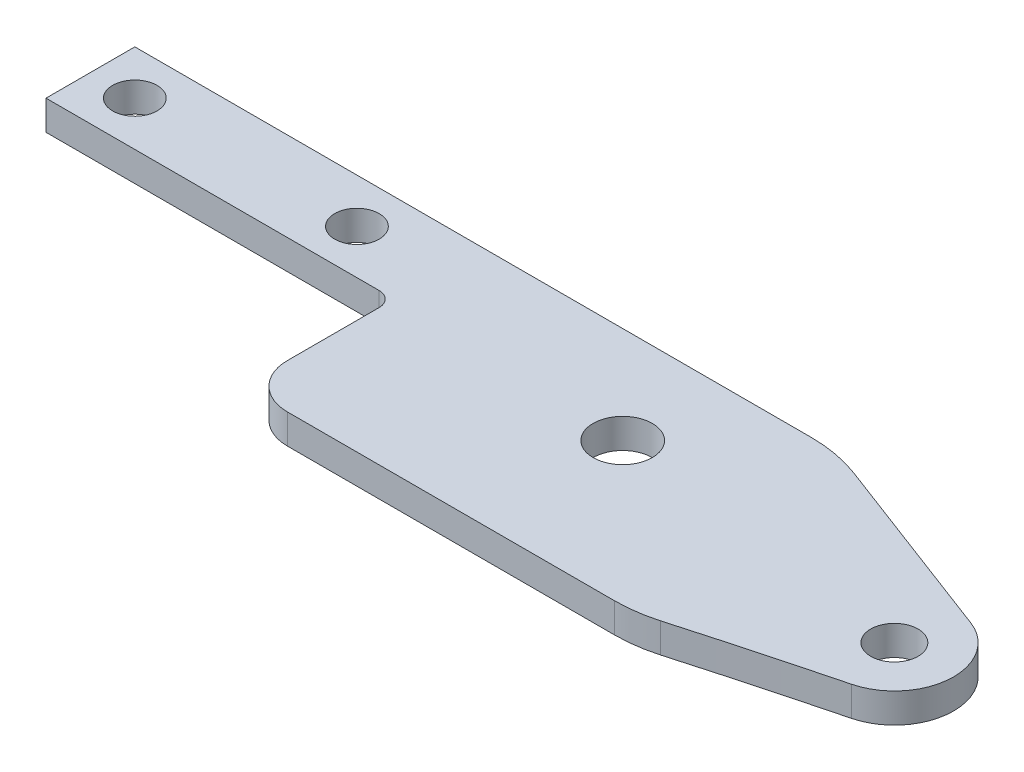
ISO-10303-21;
HEADER;
FILE_DESCRIPTION(('STEP AP214'),'2;1');
FILE_NAME('part.step','',(''),(''),'','','');
FILE_SCHEMA(('AUTOMOTIVE_DESIGN { 1 0 10303 214 1 1 1 1 }'));
ENDSEC;
DATA;
#1=APPLICATION_CONTEXT('core data for automotive mechanical design processes');
#2=APPLICATION_PROTOCOL_DEFINITION('international standard','automotive_design',2000,#1);
#3=PRODUCT_CONTEXT('',#1,'mechanical');
#4=PRODUCT('Part','Part','',(#3));
#5=PRODUCT_RELATED_PRODUCT_CATEGORY('part','',(#4));
#6=PRODUCT_DEFINITION_FORMATION('','',#4);
#7=PRODUCT_DEFINITION_CONTEXT('part definition',#1,'design');
#8=PRODUCT_DEFINITION('design','',#6,#7);
#9=PRODUCT_DEFINITION_SHAPE('','',#8);
#10=(LENGTH_UNIT() NAMED_UNIT(*) SI_UNIT(.MILLI.,.METRE.));
#11=(NAMED_UNIT(*) PLANE_ANGLE_UNIT() SI_UNIT($,.RADIAN.));
#12=(NAMED_UNIT(*) SI_UNIT($,.STERADIAN.) SOLID_ANGLE_UNIT());
#13=UNCERTAINTY_MEASURE_WITH_UNIT(LENGTH_MEASURE(1.E-05),#10,'distance_accuracy_value','');
#14=(GEOMETRIC_REPRESENTATION_CONTEXT(3) GLOBAL_UNCERTAINTY_ASSIGNED_CONTEXT((#13)) GLOBAL_UNIT_ASSIGNED_CONTEXT((#10,
#11,#12)) REPRESENTATION_CONTEXT('',''));
#15=CARTESIAN_POINT('',(0.,0.,0.));
#16=DIRECTION('',(0.,0.,1.));
#17=DIRECTION('',(1.,0.,0.));
#18=AXIS2_PLACEMENT_3D('',#15,#16,#17);
#19=CARTESIAN_POINT('',(57.5,2.,6.2));
#20=DIRECTION('',(0.,1.,0.));
#21=DIRECTION('',(0.,0.,1.));
#22=AXIS2_PLACEMENT_3D('',#19,#20,#21);
#23=PLANE('',#22);
#24=CARTESIAN_POINT('',(36.5,2.,3.55));
#25=DIRECTION('',(0.,1.,0.));
#26=DIRECTION('',(0.,0.,1.));
#27=AXIS2_PLACEMENT_3D('',#24,#25,#26);
#28=CIRCLE('',#27,2.00000000000001);
#29=CARTESIAN_POINT('',(36.5,2.,5.55000000000001));
#30=VERTEX_POINT('',#29);
#31=EDGE_CURVE('E417',#30,#30,#28,.T.);
#32=ORIENTED_EDGE('',*,*,#31,.F.);
#33=EDGE_LOOP('',(#32));
#34=FACE_BOUND('',#33,.T.);
#35=CARTESIAN_POINT('',(0.,2.,0.));
#36=DIRECTION('',(0.,1.,0.));
#37=DIRECTION('',(0.,0.,-1.));
#38=AXIS2_PLACEMENT_3D('',#35,#36,#37);
#39=CIRCLE('',#38,1.5);
#40=CARTESIAN_POINT('',(0.,2.,-1.5));
#41=VERTEX_POINT('',#40);
#42=EDGE_CURVE('E244',#41,#41,#39,.T.);
#43=ORIENTED_EDGE('',*,*,#42,.F.);
#44=EDGE_LOOP('',(#43));
#45=FACE_BOUND('',#44,.T.);
#46=DIRECTION('',(-0.935193561719164,0.,-0.354136982139715));
#47=VECTOR('',#46,1.);
#48=CARTESIAN_POINT('',(58.9165479285589,2.,2.45922575312334));
#49=LINE('',#48,#47);
#50=CARTESIAN_POINT('',(58.9165479285589,2.,2.45922575312334));
#51=VERTEX_POINT('',#50);
#52=CARTESIAN_POINT('',(46.2113875956134,2.,-2.35193561719164));
#53=VERTEX_POINT('',#52);
#54=EDGE_CURVE('E119',#51,#53,#49,.T.);
#55=ORIENTED_EDGE('',*,*,#54,.T.);
#56=CARTESIAN_POINT('',(42.6700177742163,2.,7.));
#57=DIRECTION('',(0.,1.,0.));
#58=DIRECTION('',(0.,0.,1.));
#59=AXIS2_PLACEMENT_3D('',#56,#57,#58);
#60=CIRCLE('',#59,10.);
#61=CARTESIAN_POINT('',(42.6700177742163,2.,-3.));
#62=VERTEX_POINT('',#61);
#63=EDGE_CURVE('E11',#53,#62,#60,.T.);
#64=ORIENTED_EDGE('',*,*,#63,.T.);
#65=DIRECTION('',(-1.,0.,0.));
#66=VECTOR('',#65,1.);
#67=CARTESIAN_POINT('',(44.5,2.,-3.));
#68=LINE('',#67,#66);
#69=CARTESIAN_POINT('',(-3.,2.,-3.));
#70=VERTEX_POINT('',#69);
#71=EDGE_CURVE('E127',#62,#70,#68,.T.);
#72=ORIENTED_EDGE('',*,*,#71,.T.);
#73=DIRECTION('',(0.,0.,1.));
#74=VECTOR('',#73,1.);
#75=CARTESIAN_POINT('',(-3.,2.,-3.));
#76=LINE('',#75,#74);
#77=CARTESIAN_POINT('',(-3.,2.,3.));
#78=VERTEX_POINT('',#77);
#79=EDGE_CURVE('E230',#70,#78,#76,.T.);
#80=ORIENTED_EDGE('',*,*,#79,.T.);
#81=DIRECTION('',(1.,0.,0.));
#82=VECTOR('',#81,1.);
#83=CARTESIAN_POINT('',(-3.,2.,3.));
#84=LINE('',#83,#82);
#85=CARTESIAN_POINT('',(19.5,2.,3.));
#86=VERTEX_POINT('',#85);
#87=EDGE_CURVE('E211',#78,#86,#84,.T.);
#88=ORIENTED_EDGE('',*,*,#87,.T.);
#89=CARTESIAN_POINT('',(19.5,2.,4.));
#90=DIRECTION('',(0.,1.,0.));
#91=DIRECTION('',(0.,0.,1.));
#92=AXIS2_PLACEMENT_3D('',#89,#90,#91);
#93=CIRCLE('',#92,1.);
#94=CARTESIAN_POINT('',(20.5,2.,4.));
#95=VERTEX_POINT('',#94);
#96=EDGE_CURVE('E156',#86,#95,#93,.F.);
#97=ORIENTED_EDGE('',*,*,#96,.T.);
#98=DIRECTION('',(0.,0.,1.));
#99=VECTOR('',#98,1.);
#100=CARTESIAN_POINT('',(20.5,2.,3.));
#101=LINE('',#100,#99);
#102=CARTESIAN_POINT('',(20.5,2.,10.2));
#103=VERTEX_POINT('',#102);
#104=EDGE_CURVE('E224',#95,#103,#101,.T.);
#105=ORIENTED_EDGE('',*,*,#104,.T.);
#106=CARTESIAN_POINT('',(23.5,2.,10.2));
#107=DIRECTION('',(0.,1.,0.));
#108=DIRECTION('',(0.,0.,1.));
#109=AXIS2_PLACEMENT_3D('',#106,#107,#108);
#110=CIRCLE('',#109,3.);
#111=CARTESIAN_POINT('',(23.5,2.,13.2));
#112=VERTEX_POINT('',#111);
#113=EDGE_CURVE('E226',#103,#112,#110,.T.);
#114=ORIENTED_EDGE('',*,*,#113,.T.);
#115=DIRECTION('',(1.,0.,0.));
#116=VECTOR('',#115,1.);
#117=CARTESIAN_POINT('',(45.5941572578322,2.,13.2));
#118=LINE('',#117,#116);
#119=CARTESIAN_POINT('',(45.5941572578322,2.,13.2));
#120=VERTEX_POINT('',#119);
#121=EDGE_CURVE('E228',#112,#120,#118,.T.);
#122=ORIENTED_EDGE('',*,*,#121,.T.);
#123=CARTESIAN_POINT('',(45.5941572578322,2.,3.19999999999998));
#124=DIRECTION('',(0.,1.,0.));
#125=DIRECTION('',(0.,0.,1.));
#126=AXIS2_PLACEMENT_3D('',#123,#124,#125);
#127=CIRCLE('',#126,10.);
#128=CARTESIAN_POINT('',(48.3339077215848,2.,12.8173680077434));
#129=VERTEX_POINT('',#128);
#130=EDGE_CURVE('E235',#120,#129,#127,.T.);
#131=ORIENTED_EDGE('',*,*,#130,.T.);
#132=CARTESIAN_POINT('',(152.444425344187,2.,378.277352301994));
#133=DIRECTION('',(0.,-1.,0.));
#134=DIRECTION('',(0.,0.,1.));
#135=AXIS2_PLACEMENT_3D('',#132,#133,#134);
#136=CIRCLE('',#135,380.);
#137=CARTESIAN_POINT('',(58.4890044306687,2.,10.0758057531458));
#138=VERTEX_POINT('',#137);
#139=EDGE_CURVE('E133',#129,#138,#136,.T.);
#140=ORIENTED_EDGE('',*,*,#139,.T.);
#141=CARTESIAN_POINT('',(57.5,2.,6.2));
#142=DIRECTION('',(0.,1.,0.));
#143=DIRECTION('',(0.,0.,1.));
#144=AXIS2_PLACEMENT_3D('',#141,#142,#143);
#145=CIRCLE('',#144,4.00000000000002);
#146=EDGE_CURVE('E128',#138,#51,#145,.T.);
#147=ORIENTED_EDGE('',*,*,#146,.T.);
#148=EDGE_LOOP('',(#55,#64,#72,#80,#88,#97,#105,#114,#122,#131,#140,#147));
#149=FACE_BOUND('',#148,.T.);
#150=CARTESIAN_POINT('',(57.5,2.,6.2));
#151=DIRECTION('',(0.,1.,0.));
#152=DIRECTION('',(0.,0.,1.));
#153=AXIS2_PLACEMENT_3D('',#150,#151,#152);
#154=CIRCLE('',#153,1.60000000000001);
#155=CARTESIAN_POINT('',(57.5,2.,7.8));
#156=VERTEX_POINT('',#155);
#157=EDGE_CURVE('E237',#156,#156,#154,.T.);
#158=ORIENTED_EDGE('',*,*,#157,.F.);
#159=EDGE_LOOP('',(#158));
#160=FACE_BOUND('',#159,.T.);
#161=CARTESIAN_POINT('',(15.,2.,0.));
#162=DIRECTION('',(0.,1.,0.));
#163=DIRECTION('',(0.,0.,-1.));
#164=AXIS2_PLACEMENT_3D('',#161,#162,#163);
#165=CIRCLE('',#164,1.5);
#166=CARTESIAN_POINT('',(15.,2.,-1.50000000000001));
#167=VERTEX_POINT('',#166);
#168=EDGE_CURVE('E422',#167,#167,#165,.T.);
#169=ORIENTED_EDGE('',*,*,#168,.F.);
#170=EDGE_LOOP('',(#169));
#171=FACE_BOUND('',#170,.T.);
#172=ADVANCED_FACE('F34',(#34,#45,#149,#160,#171),#23,.T.);
#173=CARTESIAN_POINT('',(57.5,0.,6.2));
#174=DIRECTION('',(0.,1.,0.));
#175=DIRECTION('',(0.,0.,1.));
#176=AXIS2_PLACEMENT_3D('',#173,#174,#175);
#177=PLANE('',#176);
#178=CARTESIAN_POINT('',(36.5,0.,3.55));
#179=DIRECTION('',(0.,1.,0.));
#180=DIRECTION('',(0.,0.,1.));
#181=AXIS2_PLACEMENT_3D('',#178,#179,#180);
#182=CIRCLE('',#181,2.00000000000001);
#183=CARTESIAN_POINT('',(36.5,0.,5.55000000000001));
#184=VERTEX_POINT('',#183);
#185=EDGE_CURVE('E415',#184,#184,#182,.T.);
#186=ORIENTED_EDGE('',*,*,#185,.T.);
#187=EDGE_LOOP('',(#186));
#188=FACE_BOUND('',#187,.T.);
#189=DIRECTION('',(-1.,0.,0.));
#190=VECTOR('',#189,1.);
#191=CARTESIAN_POINT('',(44.5,0.,-3.));
#192=LINE('',#191,#190);
#193=CARTESIAN_POINT('',(42.6700177742163,0.,-3.));
#194=VERTEX_POINT('',#193);
#195=CARTESIAN_POINT('',(-3.,0.,-3.));
#196=VERTEX_POINT('',#195);
#197=EDGE_CURVE('E166',#194,#196,#192,.T.);
#198=ORIENTED_EDGE('',*,*,#197,.F.);
#199=CARTESIAN_POINT('',(42.6700177742163,0.,7.));
#200=DIRECTION('',(0.,1.,0.));
#201=DIRECTION('',(0.,0.,1.));
#202=AXIS2_PLACEMENT_3D('',#199,#200,#201);
#203=CIRCLE('',#202,10.);
#204=CARTESIAN_POINT('',(46.2113875956134,0.,-2.35193561719164));
#205=VERTEX_POINT('',#204);
#206=EDGE_CURVE('E56',#194,#205,#203,.F.);
#207=ORIENTED_EDGE('',*,*,#206,.T.);
#208=DIRECTION('',(-0.935193561719164,0.,-0.354136982139715));
#209=VECTOR('',#208,1.);
#210=CARTESIAN_POINT('',(58.9165479285589,0.,2.45922575312334));
#211=LINE('',#210,#209);
#212=CARTESIAN_POINT('',(58.9165479285589,0.,2.45922575312334));
#213=VERTEX_POINT('',#212);
#214=EDGE_CURVE('E173',#213,#205,#211,.T.);
#215=ORIENTED_EDGE('',*,*,#214,.F.);
#216=CARTESIAN_POINT('',(57.5,0.,6.2));
#217=DIRECTION('',(0.,1.,0.));
#218=DIRECTION('',(0.,0.,1.));
#219=AXIS2_PLACEMENT_3D('',#216,#217,#218);
#220=CIRCLE('',#219,4.00000000000002);
#221=CARTESIAN_POINT('',(58.4890044306687,0.,10.0758057531458));
#222=VERTEX_POINT('',#221);
#223=EDGE_CURVE('E141',#222,#213,#220,.T.);
#224=ORIENTED_EDGE('',*,*,#223,.F.);
#225=CARTESIAN_POINT('',(152.444425344187,0.,378.277352301994));
#226=DIRECTION('',(0.,-1.,0.));
#227=DIRECTION('',(0.,0.,1.));
#228=AXIS2_PLACEMENT_3D('',#225,#226,#227);
#229=CIRCLE('',#228,380.);
#230=CARTESIAN_POINT('',(48.3339077215848,0.,12.8173680077434));
#231=VERTEX_POINT('',#230);
#232=EDGE_CURVE('E137',#231,#222,#229,.T.);
#233=ORIENTED_EDGE('',*,*,#232,.F.);
#234=CARTESIAN_POINT('',(45.5941572578322,0.,3.19999999999998));
#235=DIRECTION('',(0.,1.,0.));
#236=DIRECTION('',(0.,0.,1.));
#237=AXIS2_PLACEMENT_3D('',#234,#235,#236);
#238=CIRCLE('',#237,10.);
#239=CARTESIAN_POINT('',(45.5941572578322,0.,13.2));
#240=VERTEX_POINT('',#239);
#241=EDGE_CURVE('E188',#240,#231,#238,.T.);
#242=ORIENTED_EDGE('',*,*,#241,.F.);
#243=DIRECTION('',(1.,0.,0.));
#244=VECTOR('',#243,1.);
#245=CARTESIAN_POINT('',(45.5941572578322,0.,13.2));
#246=LINE('',#245,#244);
#247=CARTESIAN_POINT('',(23.5,0.,13.2));
#248=VERTEX_POINT('',#247);
#249=EDGE_CURVE('E186',#248,#240,#246,.T.);
#250=ORIENTED_EDGE('',*,*,#249,.F.);
#251=CARTESIAN_POINT('',(23.5,0.,10.2));
#252=DIRECTION('',(0.,1.,0.));
#253=DIRECTION('',(0.,0.,1.));
#254=AXIS2_PLACEMENT_3D('',#251,#252,#253);
#255=CIRCLE('',#254,3.);
#256=CARTESIAN_POINT('',(20.5,0.,10.2));
#257=VERTEX_POINT('',#256);
#258=EDGE_CURVE('E184',#257,#248,#255,.T.);
#259=ORIENTED_EDGE('',*,*,#258,.F.);
#260=DIRECTION('',(0.,0.,1.));
#261=VECTOR('',#260,1.);
#262=CARTESIAN_POINT('',(20.5,0.,3.));
#263=LINE('',#262,#261);
#264=CARTESIAN_POINT('',(20.5,0.,4.));
#265=VERTEX_POINT('',#264);
#266=EDGE_CURVE('E182',#265,#257,#263,.T.);
#267=ORIENTED_EDGE('',*,*,#266,.F.);
#268=CARTESIAN_POINT('',(19.5,0.,4.));
#269=DIRECTION('',(0.,1.,0.));
#270=DIRECTION('',(0.,0.,1.));
#271=AXIS2_PLACEMENT_3D('',#268,#269,#270);
#272=CIRCLE('',#271,1.);
#273=CARTESIAN_POINT('',(19.5,0.,3.));
#274=VERTEX_POINT('',#273);
#275=EDGE_CURVE('E154',#265,#274,#272,.T.);
#276=ORIENTED_EDGE('',*,*,#275,.T.);
#277=DIRECTION('',(1.,0.,0.));
#278=VECTOR('',#277,1.);
#279=CARTESIAN_POINT('',(-3.,0.,3.));
#280=LINE('',#279,#278);
#281=CARTESIAN_POINT('',(-3.,0.,3.));
#282=VERTEX_POINT('',#281);
#283=EDGE_CURVE('E175',#282,#274,#280,.T.);
#284=ORIENTED_EDGE('',*,*,#283,.F.);
#285=DIRECTION('',(0.,0.,1.));
#286=VECTOR('',#285,1.);
#287=CARTESIAN_POINT('',(-3.,0.,-3.));
#288=LINE('',#287,#286);
#289=EDGE_CURVE('E172',#196,#282,#288,.T.);
#290=ORIENTED_EDGE('',*,*,#289,.F.);
#291=EDGE_LOOP('',(#198,#207,#215,#224,#233,#242,#250,#259,#267,#276,#284,#290));
#292=FACE_BOUND('',#291,.T.);
#293=CARTESIAN_POINT('',(57.5,0.,6.2));
#294=DIRECTION('',(0.,1.,0.));
#295=DIRECTION('',(0.,0.,1.));
#296=AXIS2_PLACEMENT_3D('',#293,#294,#295);
#297=CIRCLE('',#296,1.60000000000001);
#298=CARTESIAN_POINT('',(57.5,0.,7.8));
#299=VERTEX_POINT('',#298);
#300=EDGE_CURVE('E239',#299,#299,#297,.T.);
#301=ORIENTED_EDGE('',*,*,#300,.T.);
#302=EDGE_LOOP('',(#301));
#303=FACE_BOUND('',#302,.T.);
#304=CARTESIAN_POINT('',(0.,0.,0.));
#305=DIRECTION('',(0.,1.,0.));
#306=DIRECTION('',(0.,0.,-1.));
#307=AXIS2_PLACEMENT_3D('',#304,#305,#306);
#308=CIRCLE('',#307,1.5);
#309=CARTESIAN_POINT('',(0.,0.,-1.5));
#310=VERTEX_POINT('',#309);
#311=EDGE_CURVE('E247',#310,#310,#308,.T.);
#312=ORIENTED_EDGE('',*,*,#311,.T.);
#313=EDGE_LOOP('',(#312));
#314=FACE_BOUND('',#313,.T.);
#315=CARTESIAN_POINT('',(15.,0.,0.));
#316=DIRECTION('',(0.,1.,0.));
#317=DIRECTION('',(0.,0.,-1.));
#318=AXIS2_PLACEMENT_3D('',#315,#316,#317);
#319=CIRCLE('',#318,1.5);
#320=CARTESIAN_POINT('',(15.,0.,-1.50000000000001));
#321=VERTEX_POINT('',#320);
#322=EDGE_CURVE('E419',#321,#321,#319,.T.);
#323=ORIENTED_EDGE('',*,*,#322,.T.);
#324=EDGE_LOOP('',(#323));
#325=FACE_BOUND('',#324,.T.);
#326=ADVANCED_FACE('F169',(#188,#292,#303,#314,#325),#177,.F.);
#327=CARTESIAN_POINT('',(57.5,2.,6.2));
#328=DIRECTION('',(0.,-1.,0.));
#329=DIRECTION('',(0.,0.,-1.));
#330=AXIS2_PLACEMENT_3D('',#327,#328,#329);
#331=CYLINDRICAL_SURFACE('',#330,4.00000000000002);
#332=ORIENTED_EDGE('',*,*,#223,.T.);
#333=DIRECTION('',(0.,-1.,0.));
#334=VECTOR('',#333,1.);
#335=CARTESIAN_POINT('',(58.9165479285589,2.,2.45922575312334));
#336=LINE('',#335,#334);
#337=EDGE_CURVE('E123',#51,#213,#336,.T.);
#338=ORIENTED_EDGE('',*,*,#337,.F.);
#339=ORIENTED_EDGE('',*,*,#146,.F.);
#340=DIRECTION('',(0.,-1.,0.));
#341=VECTOR('',#340,1.);
#342=CARTESIAN_POINT('',(58.4890044306687,2.,10.0758057531458));
#343=LINE('',#342,#341);
#344=EDGE_CURVE('E191',#138,#222,#343,.T.);
#345=ORIENTED_EDGE('',*,*,#344,.T.);
#346=EDGE_LOOP('',(#332,#338,#339,#345));
#347=FACE_BOUND('',#346,.T.);
#348=ADVANCED_FACE('F139',(#347),#331,.T.);
#349=CARTESIAN_POINT('',(58.9165479285589,2.,2.45922575312334));
#350=DIRECTION('',(-0.354136982139715,0.,0.935193561719164));
#351=DIRECTION('',(0.935193561719164,0.,0.354136982139715));
#352=AXIS2_PLACEMENT_3D('',#349,#350,#351);
#353=PLANE('',#352);
#354=ORIENTED_EDGE('',*,*,#214,.T.);
#355=DIRECTION('',(0.,-1.,0.));
#356=VECTOR('',#355,1.);
#357=CARTESIAN_POINT('',(46.2113875956134,2.,-2.35193561719164));
#358=LINE('',#357,#356);
#359=EDGE_CURVE('E42',#205,#53,#358,.F.);
#360=ORIENTED_EDGE('',*,*,#359,.T.);
#361=ORIENTED_EDGE('',*,*,#54,.F.);
#362=ORIENTED_EDGE('',*,*,#337,.T.);
#363=EDGE_LOOP('',(#354,#360,#361,#362));
#364=FACE_BOUND('',#363,.T.);
#365=ADVANCED_FACE('F121',(#364),#353,.F.);
#366=CARTESIAN_POINT('',(44.5,2.,-3.));
#367=DIRECTION('',(0.,0.,1.));
#368=DIRECTION('',(1.,0.,0.));
#369=AXIS2_PLACEMENT_3D('',#366,#367,#368);
#370=PLANE('',#369);
#371=ORIENTED_EDGE('',*,*,#71,.F.);
#372=DIRECTION('',(0.,-1.,0.));
#373=VECTOR('',#372,1.);
#374=CARTESIAN_POINT('',(42.6700177742163,2.,-3.));
#375=LINE('',#374,#373);
#376=EDGE_CURVE('E158',#62,#194,#375,.T.);
#377=ORIENTED_EDGE('',*,*,#376,.T.);
#378=ORIENTED_EDGE('',*,*,#197,.T.);
#379=DIRECTION('',(0.,-1.,0.));
#380=VECTOR('',#379,1.);
#381=CARTESIAN_POINT('',(-3.,2.,-3.));
#382=LINE('',#381,#380);
#383=EDGE_CURVE('E143',#70,#196,#382,.T.);
#384=ORIENTED_EDGE('',*,*,#383,.F.);
#385=EDGE_LOOP('',(#371,#377,#378,#384));
#386=FACE_BOUND('',#385,.T.);
#387=ADVANCED_FACE('F164',(#386),#370,.F.);
#388=CARTESIAN_POINT('',(-3.,2.,-3.));
#389=DIRECTION('',(1.,0.,0.));
#390=DIRECTION('',(0.,0.,-1.));
#391=AXIS2_PLACEMENT_3D('',#388,#389,#390);
#392=PLANE('',#391);
#393=ORIENTED_EDGE('',*,*,#289,.T.);
#394=DIRECTION('',(0.,-1.,0.));
#395=VECTOR('',#394,1.);
#396=CARTESIAN_POINT('',(-3.,2.,3.));
#397=LINE('',#396,#395);
#398=EDGE_CURVE('E149',#78,#282,#397,.T.);
#399=ORIENTED_EDGE('',*,*,#398,.F.);
#400=ORIENTED_EDGE('',*,*,#79,.F.);
#401=ORIENTED_EDGE('',*,*,#383,.T.);
#402=EDGE_LOOP('',(#393,#399,#400,#401));
#403=FACE_BOUND('',#402,.T.);
#404=ADVANCED_FACE('F250',(#403),#392,.F.);
#405=CARTESIAN_POINT('',(-3.,2.,3.));
#406=DIRECTION('',(0.,0.,-1.));
#407=DIRECTION('',(-1.,0.,0.));
#408=AXIS2_PLACEMENT_3D('',#405,#406,#407);
#409=PLANE('',#408);
#410=ORIENTED_EDGE('',*,*,#283,.T.);
#411=DIRECTION('',(0.,-1.,0.));
#412=VECTOR('',#411,1.);
#413=CARTESIAN_POINT('',(19.5,2.,3.));
#414=LINE('',#413,#412);
#415=EDGE_CURVE('E146',#274,#86,#414,.F.);
#416=ORIENTED_EDGE('',*,*,#415,.T.);
#417=ORIENTED_EDGE('',*,*,#87,.F.);
#418=ORIENTED_EDGE('',*,*,#398,.T.);
#419=EDGE_LOOP('',(#410,#416,#417,#418));
#420=FACE_BOUND('',#419,.T.);
#421=ADVANCED_FACE('F208',(#420),#409,.F.);
#422=CARTESIAN_POINT('',(20.5,2.,3.));
#423=DIRECTION('',(1.,0.,0.));
#424=DIRECTION('',(0.,0.,-1.));
#425=AXIS2_PLACEMENT_3D('',#422,#423,#424);
#426=PLANE('',#425);
#427=ORIENTED_EDGE('',*,*,#104,.F.);
#428=DIRECTION('',(0.,-1.,0.));
#429=VECTOR('',#428,1.);
#430=CARTESIAN_POINT('',(20.5,0.,4.));
#431=LINE('',#430,#429);
#432=EDGE_CURVE('E142',#95,#265,#431,.T.);
#433=ORIENTED_EDGE('',*,*,#432,.T.);
#434=ORIENTED_EDGE('',*,*,#266,.T.);
#435=DIRECTION('',(0.,-1.,0.));
#436=VECTOR('',#435,1.);
#437=CARTESIAN_POINT('',(20.5,2.,10.2));
#438=LINE('',#437,#436);
#439=EDGE_CURVE('E202',#103,#257,#438,.T.);
#440=ORIENTED_EDGE('',*,*,#439,.F.);
#441=EDGE_LOOP('',(#427,#433,#434,#440));
#442=FACE_BOUND('',#441,.T.);
#443=ADVANCED_FACE('F222',(#442),#426,.F.);
#444=CARTESIAN_POINT('',(23.5,2.,10.2));
#445=DIRECTION('',(0.,-1.,0.));
#446=DIRECTION('',(0.,0.,-1.));
#447=AXIS2_PLACEMENT_3D('',#444,#445,#446);
#448=CYLINDRICAL_SURFACE('',#447,3.);
#449=ORIENTED_EDGE('',*,*,#258,.T.);
#450=DIRECTION('',(0.,-1.,0.));
#451=VECTOR('',#450,1.);
#452=CARTESIAN_POINT('',(23.5,2.,13.2));
#453=LINE('',#452,#451);
#454=EDGE_CURVE('E199',#112,#248,#453,.T.);
#455=ORIENTED_EDGE('',*,*,#454,.F.);
#456=ORIENTED_EDGE('',*,*,#113,.F.);
#457=ORIENTED_EDGE('',*,*,#439,.T.);
#458=EDGE_LOOP('',(#449,#455,#456,#457));
#459=FACE_BOUND('',#458,.T.);
#460=ADVANCED_FACE('F284',(#459),#448,.T.);
#461=CARTESIAN_POINT('',(45.5941572578322,2.,13.2));
#462=DIRECTION('',(0.,0.,-1.));
#463=DIRECTION('',(-1.,0.,0.));
#464=AXIS2_PLACEMENT_3D('',#461,#462,#463);
#465=PLANE('',#464);
#466=ORIENTED_EDGE('',*,*,#249,.T.);
#467=DIRECTION('',(0.,-1.,0.));
#468=VECTOR('',#467,1.);
#469=CARTESIAN_POINT('',(45.5941572578322,2.,13.2));
#470=LINE('',#469,#468);
#471=EDGE_CURVE('E196',#120,#240,#470,.T.);
#472=ORIENTED_EDGE('',*,*,#471,.F.);
#473=ORIENTED_EDGE('',*,*,#121,.F.);
#474=ORIENTED_EDGE('',*,*,#454,.T.);
#475=EDGE_LOOP('',(#466,#472,#473,#474));
#476=FACE_BOUND('',#475,.T.);
#477=ADVANCED_FACE('F280',(#476),#465,.F.);
#478=CARTESIAN_POINT('',(45.5941572578322,2.,3.19999999999998));
#479=DIRECTION('',(0.,-1.,0.));
#480=DIRECTION('',(0.,0.,-1.));
#481=AXIS2_PLACEMENT_3D('',#478,#479,#480);
#482=CYLINDRICAL_SURFACE('',#481,10.);
#483=ORIENTED_EDGE('',*,*,#241,.T.);
#484=DIRECTION('',(0.,-1.,0.));
#485=VECTOR('',#484,1.);
#486=CARTESIAN_POINT('',(48.3339077215848,2.,12.8173680077434));
#487=LINE('',#486,#485);
#488=EDGE_CURVE('E193',#129,#231,#487,.T.);
#489=ORIENTED_EDGE('',*,*,#488,.F.);
#490=ORIENTED_EDGE('',*,*,#130,.F.);
#491=ORIENTED_EDGE('',*,*,#471,.T.);
#492=EDGE_LOOP('',(#483,#489,#490,#491));
#493=FACE_BOUND('',#492,.T.);
#494=ADVANCED_FACE('F276',(#493),#482,.T.);
#495=CARTESIAN_POINT('',(152.444425344187,2.,378.277352301994));
#496=DIRECTION('',(0.,-1.,0.));
#497=DIRECTION('',(0.,0.,-1.));
#498=AXIS2_PLACEMENT_3D('',#495,#496,#497);
#499=CYLINDRICAL_SURFACE('',#498,380.);
#500=ORIENTED_EDGE('',*,*,#232,.T.);
#501=ORIENTED_EDGE('',*,*,#344,.F.);
#502=ORIENTED_EDGE('',*,*,#139,.F.);
#503=ORIENTED_EDGE('',*,*,#488,.T.);
#504=EDGE_LOOP('',(#500,#501,#502,#503));
#505=FACE_BOUND('',#504,.T.);
#506=ADVANCED_FACE('F273',(#505),#499,.F.);
#507=CARTESIAN_POINT('',(57.5,2.,6.2));
#508=DIRECTION('',(0.,-1.,0.));
#509=DIRECTION('',(0.,0.,-1.));
#510=AXIS2_PLACEMENT_3D('',#507,#508,#509);
#511=CYLINDRICAL_SURFACE('',#510,1.60000000000001);
#512=ORIENTED_EDGE('',*,*,#157,.T.);
#513=EDGE_LOOP('',(#512));
#514=FACE_BOUND('',#513,.T.);
#515=ORIENTED_EDGE('',*,*,#300,.F.);
#516=EDGE_LOOP('',(#515));
#517=FACE_BOUND('',#516,.T.);
#518=ADVANCED_FACE('F270',(#514,#517),#511,.F.);
#519=CARTESIAN_POINT('',(0.,2.,0.));
#520=DIRECTION('',(0.,-1.,0.));
#521=DIRECTION('',(0.,0.,-1.));
#522=AXIS2_PLACEMENT_3D('',#519,#520,#521);
#523=CYLINDRICAL_SURFACE('',#522,1.5);
#524=ORIENTED_EDGE('',*,*,#42,.T.);
#525=EDGE_LOOP('',(#524));
#526=FACE_BOUND('',#525,.T.);
#527=ORIENTED_EDGE('',*,*,#311,.F.);
#528=EDGE_LOOP('',(#527));
#529=FACE_BOUND('',#528,.T.);
#530=ADVANCED_FACE('F317',(#526,#529),#523,.F.);
#531=CARTESIAN_POINT('',(15.,2.,0.));
#532=DIRECTION('',(0.,-1.,0.));
#533=DIRECTION('',(0.,0.,-1.));
#534=AXIS2_PLACEMENT_3D('',#531,#532,#533);
#535=CYLINDRICAL_SURFACE('',#534,1.5);
#536=ORIENTED_EDGE('',*,*,#168,.T.);
#537=EDGE_LOOP('',(#536));
#538=FACE_BOUND('',#537,.T.);
#539=ORIENTED_EDGE('',*,*,#322,.F.);
#540=EDGE_LOOP('',(#539));
#541=FACE_BOUND('',#540,.T.);
#542=ADVANCED_FACE('F323',(#538,#541),#535,.F.);
#543=CARTESIAN_POINT('',(19.5,2.,4.));
#544=DIRECTION('',(0.,1.,0.));
#545=DIRECTION('',(0.,0.,1.));
#546=AXIS2_PLACEMENT_3D('',#543,#544,#545);
#547=CYLINDRICAL_SURFACE('',#546,1.);
#548=ORIENTED_EDGE('',*,*,#96,.F.);
#549=ORIENTED_EDGE('',*,*,#415,.F.);
#550=ORIENTED_EDGE('',*,*,#275,.F.);
#551=ORIENTED_EDGE('',*,*,#432,.F.);
#552=EDGE_LOOP('',(#548,#549,#550,#551));
#553=FACE_BOUND('',#552,.T.);
#554=ADVANCED_FACE('F219',(#553),#547,.F.);
#555=CARTESIAN_POINT('',(42.6700177742163,2.,7.));
#556=DIRECTION('',(0.,-1.,0.));
#557=DIRECTION('',(0.,0.,-1.));
#558=AXIS2_PLACEMENT_3D('',#555,#556,#557);
#559=CYLINDRICAL_SURFACE('',#558,10.);
#560=ORIENTED_EDGE('',*,*,#63,.F.);
#561=ORIENTED_EDGE('',*,*,#359,.F.);
#562=ORIENTED_EDGE('',*,*,#206,.F.);
#563=ORIENTED_EDGE('',*,*,#376,.F.);
#564=EDGE_LOOP('',(#560,#561,#562,#563));
#565=FACE_BOUND('',#564,.T.);
#566=ADVANCED_FACE('F36',(#565),#559,.T.);
#567=CARTESIAN_POINT('',(36.5,0.,3.55));
#568=DIRECTION('',(0.,1.,0.));
#569=DIRECTION('',(0.,0.,1.));
#570=AXIS2_PLACEMENT_3D('',#567,#568,#569);
#571=CYLINDRICAL_SURFACE('',#570,2.00000000000001);
#572=ORIENTED_EDGE('',*,*,#185,.F.);
#573=EDGE_LOOP('',(#572));
#574=FACE_BOUND('',#573,.T.);
#575=ORIENTED_EDGE('',*,*,#31,.T.);
#576=EDGE_LOOP('',(#575));
#577=FACE_BOUND('',#576,.T.);
#578=ADVANCED_FACE('F342',(#574,#577),#571,.F.);
#579=CLOSED_SHELL('',(#172,#326,#348,#365,#387,#404,#421,#443,#460,#477,#494,#506,#518,#530,
#542,#554,#566,#578));
#580=MANIFOLD_SOLID_BREP('B2',#579);
#581=ADVANCED_BREP_SHAPE_REPRESENTATION('',(#18,#580),#14);
#582=SHAPE_DEFINITION_REPRESENTATION(#9,#581);
ENDSEC;
END-ISO-10303-21;
